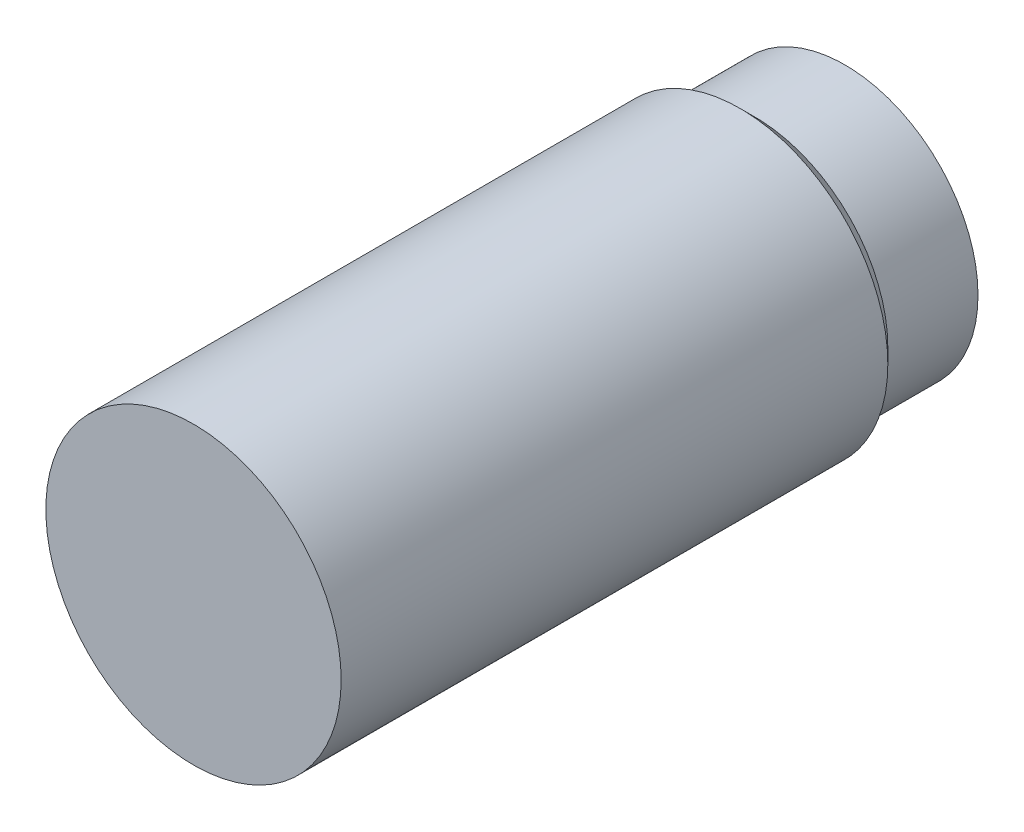
ISO-10303-21;
HEADER;
FILE_DESCRIPTION(('STEP AP214'),'2;1');
FILE_NAME('part.step','',(''),(''),'','','');
FILE_SCHEMA(('AUTOMOTIVE_DESIGN { 1 0 10303 214 1 1 1 1 }'));
ENDSEC;
DATA;
#1=APPLICATION_CONTEXT('core data for automotive mechanical design processes');
#2=APPLICATION_PROTOCOL_DEFINITION('international standard','automotive_design',2000,#1);
#3=PRODUCT_CONTEXT('',#1,'mechanical');
#4=PRODUCT('Part','Part','',(#3));
#5=PRODUCT_RELATED_PRODUCT_CATEGORY('part','',(#4));
#6=PRODUCT_DEFINITION_FORMATION('','',#4);
#7=PRODUCT_DEFINITION_CONTEXT('part definition',#1,'design');
#8=PRODUCT_DEFINITION('design','',#6,#7);
#9=PRODUCT_DEFINITION_SHAPE('','',#8);
#10=(LENGTH_UNIT() NAMED_UNIT(*) SI_UNIT(.MILLI.,.METRE.));
#11=(NAMED_UNIT(*) PLANE_ANGLE_UNIT() SI_UNIT($,.RADIAN.));
#12=(NAMED_UNIT(*) SI_UNIT($,.STERADIAN.) SOLID_ANGLE_UNIT());
#13=UNCERTAINTY_MEASURE_WITH_UNIT(LENGTH_MEASURE(1.E-05),#10,'distance_accuracy_value','');
#14=(GEOMETRIC_REPRESENTATION_CONTEXT(3) GLOBAL_UNCERTAINTY_ASSIGNED_CONTEXT((#13)) GLOBAL_UNIT_ASSIGNED_CONTEXT((#10,
#11,#12)) REPRESENTATION_CONTEXT('',''));
#15=CARTESIAN_POINT('',(0.,0.,0.));
#16=DIRECTION('',(0.,0.,1.));
#17=DIRECTION('',(1.,0.,0.));
#18=AXIS2_PLACEMENT_3D('',#15,#16,#17);
#19=CARTESIAN_POINT('',(0.,0.,0.));
#20=DIRECTION('',(0.,0.,-1.));
#21=DIRECTION('',(-1.,0.,0.));
#22=AXIS2_PLACEMENT_3D('',#19,#20,#21);
#23=PLANE('',#22);
#24=CARTESIAN_POINT('',(0.,0.,0.));
#25=DIRECTION('',(0.,0.,1.));
#26=DIRECTION('',(1.,0.,0.));
#27=AXIS2_PLACEMENT_3D('',#24,#25,#26);
#28=CIRCLE('',#27,6.55);
#29=CARTESIAN_POINT('',(6.55,0.,0.));
#30=VERTEX_POINT('',#29);
#31=EDGE_CURVE('E10',#30,#30,#28,.T.);
#32=ORIENTED_EDGE('',*,*,#31,.T.);
#33=EDGE_LOOP('',(#32));
#34=FACE_BOUND('',#33,.T.);
#35=ADVANCED_FACE('F41',(#34),#23,.F.);
#36=CARTESIAN_POINT('',(0.,0.,0.));
#37=DIRECTION('',(0.,0.,1.));
#38=DIRECTION('',(1.,0.,0.));
#39=AXIS2_PLACEMENT_3D('',#36,#37,#38);
#40=CYLINDRICAL_SURFACE('',#39,6.55);
#41=ORIENTED_EDGE('',*,*,#31,.F.);
#42=EDGE_LOOP('',(#41));
#43=FACE_BOUND('',#42,.T.);
#44=CARTESIAN_POINT('',(0.,0.,-24.25));
#45=DIRECTION('',(0.,0.,1.));
#46=DIRECTION('',(1.,0.,0.));
#47=AXIS2_PLACEMENT_3D('',#44,#45,#46);
#48=CIRCLE('',#47,6.55);
#49=CARTESIAN_POINT('',(6.55,0.,-24.25));
#50=VERTEX_POINT('',#49);
#51=EDGE_CURVE('E47',#50,#50,#48,.T.);
#52=ORIENTED_EDGE('',*,*,#51,.T.);
#53=EDGE_LOOP('',(#52));
#54=FACE_BOUND('',#53,.T.);
#55=ADVANCED_FACE('F89',(#43,#54),#40,.T.);
#56=CARTESIAN_POINT('',(0.,0.,-24.9));
#57=DIRECTION('',(0.,0.,1.));
#58=DIRECTION('',(1.,0.,0.));
#59=AXIS2_PLACEMENT_3D('',#56,#57,#58);
#60=CONICAL_SURFACE('',#59,5.9,0.785398163397449);
#61=ORIENTED_EDGE('',*,*,#51,.F.);
#62=EDGE_LOOP('',(#61));
#63=FACE_BOUND('',#62,.T.);
#64=CARTESIAN_POINT('',(0.,0.,-24.9));
#65=DIRECTION('',(0.,0.,1.));
#66=DIRECTION('',(1.,0.,0.));
#67=AXIS2_PLACEMENT_3D('',#64,#65,#66);
#68=CIRCLE('',#67,5.9);
#69=CARTESIAN_POINT('',(5.9,0.,-24.9));
#70=VERTEX_POINT('',#69);
#71=EDGE_CURVE('E51',#70,#70,#68,.T.);
#72=ORIENTED_EDGE('',*,*,#71,.T.);
#73=EDGE_LOOP('',(#72));
#74=FACE_BOUND('',#73,.T.);
#75=ADVANCED_FACE('F83',(#63,#74),#60,.T.);
#76=CARTESIAN_POINT('',(0.,0.,0.));
#77=DIRECTION('',(0.,0.,1.));
#78=DIRECTION('',(1.,0.,0.));
#79=AXIS2_PLACEMENT_3D('',#76,#77,#78);
#80=CYLINDRICAL_SURFACE('',#79,5.9);
#81=ORIENTED_EDGE('',*,*,#71,.F.);
#82=EDGE_LOOP('',(#81));
#83=FACE_BOUND('',#82,.T.);
#84=CARTESIAN_POINT('',(0.,0.,-28.9));
#85=DIRECTION('',(0.,0.,1.));
#86=DIRECTION('',(1.,0.,0.));
#87=AXIS2_PLACEMENT_3D('',#84,#85,#86);
#88=CIRCLE('',#87,5.9);
#89=CARTESIAN_POINT('',(5.9,0.,-28.9));
#90=VERTEX_POINT('',#89);
#91=EDGE_CURVE('E55',#90,#90,#88,.T.);
#92=ORIENTED_EDGE('',*,*,#91,.T.);
#93=EDGE_LOOP('',(#92));
#94=FACE_BOUND('',#93,.T.);
#95=ADVANCED_FACE('F78',(#83,#94),#80,.T.);
#96=CARTESIAN_POINT('',(0.,5.9,-28.9));
#97=DIRECTION('',(0.,0.,1.));
#98=DIRECTION('',(1.,0.,0.));
#99=AXIS2_PLACEMENT_3D('',#96,#97,#98);
#100=PLANE('',#99);
#101=CARTESIAN_POINT('',(0.,0.,-28.9));
#102=DIRECTION('',(0.,0.,-1.));
#103=DIRECTION('',(-1.,0.,0.));
#104=AXIS2_PLACEMENT_3D('',#101,#102,#103);
#105=CIRCLE('',#104,5.6);
#106=CARTESIAN_POINT('',(-5.6,0.,-28.9));
#107=VERTEX_POINT('',#106);
#108=EDGE_CURVE('E61',#107,#107,#105,.T.);
#109=ORIENTED_EDGE('',*,*,#108,.F.);
#110=EDGE_LOOP('',(#109));
#111=FACE_BOUND('',#110,.T.);
#112=ORIENTED_EDGE('',*,*,#91,.F.);
#113=EDGE_LOOP('',(#112));
#114=FACE_BOUND('',#113,.T.);
#115=ADVANCED_FACE('F72',(#111,#114),#100,.F.);
#116=CARTESIAN_POINT('',(0.,0.,-28.7));
#117=DIRECTION('',(0.,0.,-1.));
#118=DIRECTION('',(-1.,0.,0.));
#119=AXIS2_PLACEMENT_3D('',#116,#117,#118);
#120=CYLINDRICAL_SURFACE('',#119,5.6);
#121=CARTESIAN_POINT('',(0.,0.,-28.7));
#122=DIRECTION('',(0.,0.,-1.));
#123=DIRECTION('',(-1.,0.,0.));
#124=AXIS2_PLACEMENT_3D('',#121,#122,#123);
#125=CIRCLE('',#124,5.6);
#126=CARTESIAN_POINT('',(-5.6,0.,-28.7));
#127=VERTEX_POINT('',#126);
#128=EDGE_CURVE('E60',#127,#127,#125,.T.);
#129=ORIENTED_EDGE('',*,*,#128,.F.);
#130=EDGE_LOOP('',(#129));
#131=FACE_BOUND('',#130,.T.);
#132=ORIENTED_EDGE('',*,*,#108,.T.);
#133=EDGE_LOOP('',(#132));
#134=FACE_BOUND('',#133,.T.);
#135=ADVANCED_FACE('F69',(#131,#134),#120,.F.);
#136=CARTESIAN_POINT('',(0.,0.,-28.7));
#137=DIRECTION('',(0.,0.,-1.));
#138=DIRECTION('',(-1.,0.,0.));
#139=AXIS2_PLACEMENT_3D('',#136,#137,#138);
#140=PLANE('',#139);
#141=ORIENTED_EDGE('',*,*,#128,.T.);
#142=EDGE_LOOP('',(#141));
#143=FACE_BOUND('',#142,.T.);
#144=ADVANCED_FACE('F67',(#143),#140,.T.);
#145=CLOSED_SHELL('',(#35,#55,#75,#95,#115,#135,#144));
#146=MANIFOLD_SOLID_BREP('B2',#145);
#147=ADVANCED_BREP_SHAPE_REPRESENTATION('',(#18,#146),#14);
#148=SHAPE_DEFINITION_REPRESENTATION(#9,#147);
ENDSEC;
END-ISO-10303-21;
